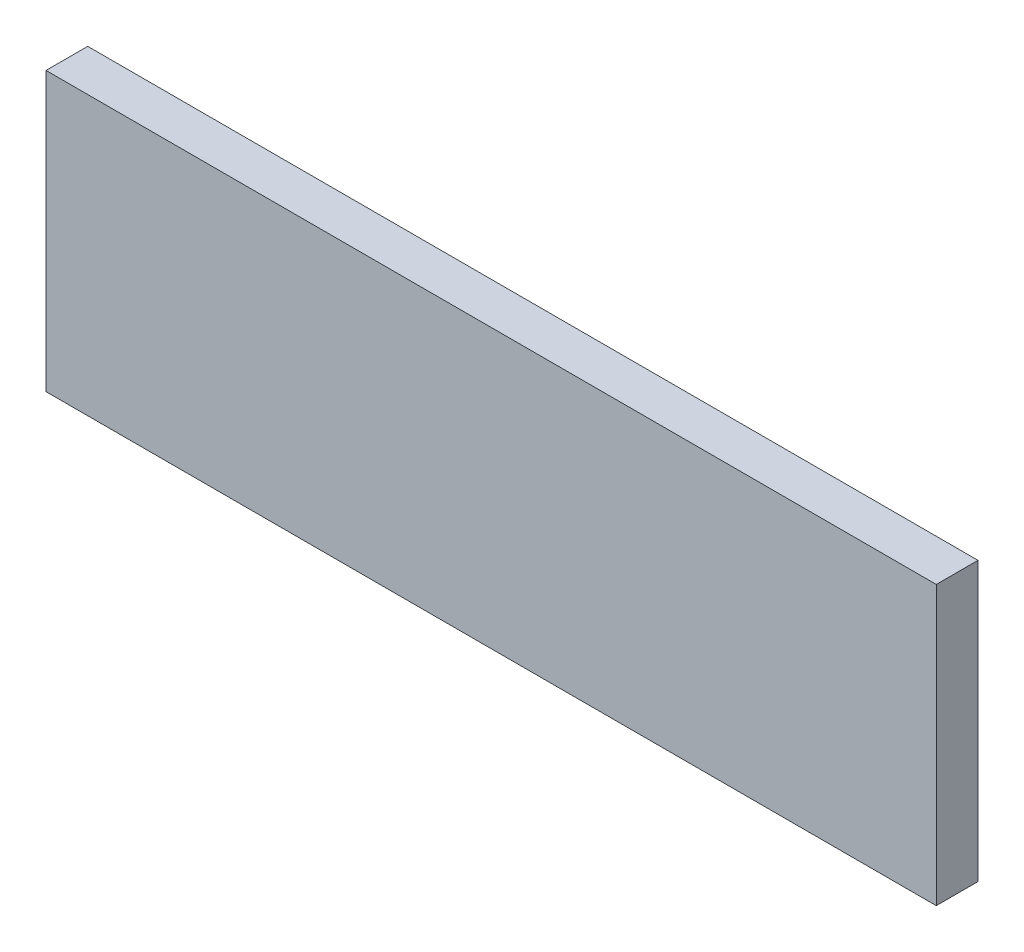
ISO-10303-21;
HEADER;
FILE_DESCRIPTION(('STEP AP214'),'2;1');
FILE_NAME('part.step','',(''),(''),'','','');
FILE_SCHEMA(('AUTOMOTIVE_DESIGN { 1 0 10303 214 1 1 1 1 }'));
ENDSEC;
DATA;
#1=APPLICATION_CONTEXT('core data for automotive mechanical design processes');
#2=APPLICATION_PROTOCOL_DEFINITION('international standard','automotive_design',2000,#1);
#3=PRODUCT_CONTEXT('',#1,'mechanical');
#4=PRODUCT('Part','Part','',(#3));
#5=PRODUCT_RELATED_PRODUCT_CATEGORY('part','',(#4));
#6=PRODUCT_DEFINITION_FORMATION('','',#4);
#7=PRODUCT_DEFINITION_CONTEXT('part definition',#1,'design');
#8=PRODUCT_DEFINITION('design','',#6,#7);
#9=PRODUCT_DEFINITION_SHAPE('','',#8);
#10=(LENGTH_UNIT() NAMED_UNIT(*) SI_UNIT(.MILLI.,.METRE.));
#11=(NAMED_UNIT(*) PLANE_ANGLE_UNIT() SI_UNIT($,.RADIAN.));
#12=(NAMED_UNIT(*) SI_UNIT($,.STERADIAN.) SOLID_ANGLE_UNIT());
#13=UNCERTAINTY_MEASURE_WITH_UNIT(LENGTH_MEASURE(1.E-05),#10,'distance_accuracy_value','');
#14=(GEOMETRIC_REPRESENTATION_CONTEXT(3) GLOBAL_UNCERTAINTY_ASSIGNED_CONTEXT((#13)) GLOBAL_UNIT_ASSIGNED_CONTEXT((#10,
#11,#12)) REPRESENTATION_CONTEXT('',''));
#15=CARTESIAN_POINT('',(0.,0.,0.));
#16=DIRECTION('',(0.,0.,1.));
#17=DIRECTION('',(1.,0.,0.));
#18=AXIS2_PLACEMENT_3D('',#15,#16,#17);
#19=CARTESIAN_POINT('',(0.,100.,0.));
#20=DIRECTION('',(1.,0.,0.));
#21=DIRECTION('',(0.,0.,-1.));
#22=AXIS2_PLACEMENT_3D('',#19,#20,#21);
#23=PLANE('',#22);
#24=DIRECTION('',(0.,0.,1.));
#25=VECTOR('',#24,1.);
#26=CARTESIAN_POINT('',(0.,0.,0.));
#27=LINE('',#26,#25);
#28=CARTESIAN_POINT('',(0.,0.,-15.));
#29=VERTEX_POINT('',#28);
#30=CARTESIAN_POINT('',(0.,0.,0.));
#31=VERTEX_POINT('',#30);
#32=EDGE_CURVE('E98',#29,#31,#27,.T.);
#33=ORIENTED_EDGE('',*,*,#32,.T.);
#34=DIRECTION('',(0.,-1.,0.));
#35=VECTOR('',#34,1.);
#36=CARTESIAN_POINT('',(0.,100.,0.));
#37=LINE('',#36,#35);
#38=CARTESIAN_POINT('',(0.,100.,0.));
#39=VERTEX_POINT('',#38);
#40=EDGE_CURVE('E11',#39,#31,#37,.T.);
#41=ORIENTED_EDGE('',*,*,#40,.F.);
#42=DIRECTION('',(0.,0.,1.));
#43=VECTOR('',#42,1.);
#44=CARTESIAN_POINT('',(0.,100.,0.));
#45=LINE('',#44,#43);
#46=CARTESIAN_POINT('',(0.,100.,-15.));
#47=VERTEX_POINT('',#46);
#48=EDGE_CURVE('E86',#47,#39,#45,.T.);
#49=ORIENTED_EDGE('',*,*,#48,.F.);
#50=DIRECTION('',(0.,-1.,0.));
#51=VECTOR('',#50,1.);
#52=CARTESIAN_POINT('',(0.,100.,-15.));
#53=LINE('',#52,#51);
#54=EDGE_CURVE('E94',#47,#29,#53,.T.);
#55=ORIENTED_EDGE('',*,*,#54,.T.);
#56=EDGE_LOOP('',(#33,#41,#49,#55));
#57=FACE_BOUND('',#56,.T.);
#58=ADVANCED_FACE('F35',(#57),#23,.F.);
#59=CARTESIAN_POINT('',(0.,100.,0.));
#60=DIRECTION('',(0.,0.,-1.));
#61=DIRECTION('',(-1.,0.,0.));
#62=AXIS2_PLACEMENT_3D('',#59,#60,#61);
#63=PLANE('',#62);
#64=DIRECTION('',(1.,0.,0.));
#65=VECTOR('',#64,1.);
#66=CARTESIAN_POINT('',(0.,0.,0.));
#67=LINE('',#66,#65);
#68=CARTESIAN_POINT('',(320.,0.,0.));
#69=VERTEX_POINT('',#68);
#70=EDGE_CURVE('E90',#31,#69,#67,.T.);
#71=ORIENTED_EDGE('',*,*,#70,.T.);
#72=DIRECTION('',(0.,-1.,0.));
#73=VECTOR('',#72,1.);
#74=CARTESIAN_POINT('',(320.,100.,0.));
#75=LINE('',#74,#73);
#76=CARTESIAN_POINT('',(320.,100.,0.));
#77=VERTEX_POINT('',#76);
#78=EDGE_CURVE('E43',#77,#69,#75,.T.);
#79=ORIENTED_EDGE('',*,*,#78,.F.);
#80=DIRECTION('',(1.,0.,0.));
#81=VECTOR('',#80,1.);
#82=CARTESIAN_POINT('',(0.,100.,0.));
#83=LINE('',#82,#81);
#84=EDGE_CURVE('E81',#39,#77,#83,.T.);
#85=ORIENTED_EDGE('',*,*,#84,.F.);
#86=ORIENTED_EDGE('',*,*,#40,.T.);
#87=EDGE_LOOP('',(#71,#79,#85,#86));
#88=FACE_BOUND('',#87,.T.);
#89=ADVANCED_FACE('F89',(#88),#63,.F.);
#90=CARTESIAN_POINT('',(320.,100.,0.));
#91=DIRECTION('',(-1.,0.,0.));
#92=DIRECTION('',(0.,0.,1.));
#93=AXIS2_PLACEMENT_3D('',#90,#91,#92);
#94=PLANE('',#93);
#95=DIRECTION('',(0.,0.,-1.));
#96=VECTOR('',#95,1.);
#97=CARTESIAN_POINT('',(320.,0.,0.));
#98=LINE('',#97,#96);
#99=CARTESIAN_POINT('',(320.,0.,-15.));
#100=VERTEX_POINT('',#99);
#101=EDGE_CURVE('E68',#69,#100,#98,.T.);
#102=ORIENTED_EDGE('',*,*,#101,.T.);
#103=DIRECTION('',(0.,-1.,0.));
#104=VECTOR('',#103,1.);
#105=CARTESIAN_POINT('',(320.,100.,-15.));
#106=LINE('',#105,#104);
#107=CARTESIAN_POINT('',(320.,100.,-15.));
#108=VERTEX_POINT('',#107);
#109=EDGE_CURVE('E91',#108,#100,#106,.T.);
#110=ORIENTED_EDGE('',*,*,#109,.F.);
#111=DIRECTION('',(0.,0.,-1.));
#112=VECTOR('',#111,1.);
#113=CARTESIAN_POINT('',(320.,100.,0.));
#114=LINE('',#113,#112);
#115=EDGE_CURVE('E84',#77,#108,#114,.T.);
#116=ORIENTED_EDGE('',*,*,#115,.F.);
#117=ORIENTED_EDGE('',*,*,#78,.T.);
#118=EDGE_LOOP('',(#102,#110,#116,#117));
#119=FACE_BOUND('',#118,.T.);
#120=ADVANCED_FACE('F92',(#119),#94,.F.);
#121=CARTESIAN_POINT('',(0.,100.,-15.));
#122=DIRECTION('',(0.,0.,1.));
#123=DIRECTION('',(1.,0.,0.));
#124=AXIS2_PLACEMENT_3D('',#121,#122,#123);
#125=PLANE('',#124);
#126=DIRECTION('',(-1.,0.,0.));
#127=VECTOR('',#126,1.);
#128=CARTESIAN_POINT('',(0.,0.,-15.));
#129=LINE('',#128,#127);
#130=EDGE_CURVE('E74',#100,#29,#129,.T.);
#131=ORIENTED_EDGE('',*,*,#130,.T.);
#132=ORIENTED_EDGE('',*,*,#54,.F.);
#133=DIRECTION('',(-1.,0.,0.));
#134=VECTOR('',#133,1.);
#135=CARTESIAN_POINT('',(0.,100.,-15.));
#136=LINE('',#135,#134);
#137=EDGE_CURVE('E51',#108,#47,#136,.T.);
#138=ORIENTED_EDGE('',*,*,#137,.F.);
#139=ORIENTED_EDGE('',*,*,#109,.T.);
#140=EDGE_LOOP('',(#131,#132,#138,#139));
#141=FACE_BOUND('',#140,.T.);
#142=ADVANCED_FACE('F105',(#141),#125,.F.);
#143=CARTESIAN_POINT('',(0.,100.,0.));
#144=DIRECTION('',(0.,-1.,0.));
#145=DIRECTION('',(0.,0.,-1.));
#146=AXIS2_PLACEMENT_3D('',#143,#144,#145);
#147=PLANE('',#146);
#148=ORIENTED_EDGE('',*,*,#48,.T.);
#149=ORIENTED_EDGE('',*,*,#84,.T.);
#150=ORIENTED_EDGE('',*,*,#115,.T.);
#151=ORIENTED_EDGE('',*,*,#137,.T.);
#152=EDGE_LOOP('',(#148,#149,#150,#151));
#153=FACE_BOUND('',#152,.T.);
#154=ADVANCED_FACE('F82',(#153),#147,.F.);
#155=CARTESIAN_POINT('',(0.,0.,0.));
#156=DIRECTION('',(0.,-1.,0.));
#157=DIRECTION('',(0.,0.,-1.));
#158=AXIS2_PLACEMENT_3D('',#155,#156,#157);
#159=PLANE('',#158);
#160=ORIENTED_EDGE('',*,*,#32,.F.);
#161=ORIENTED_EDGE('',*,*,#130,.F.);
#162=ORIENTED_EDGE('',*,*,#101,.F.);
#163=ORIENTED_EDGE('',*,*,#70,.F.);
#164=EDGE_LOOP('',(#160,#161,#162,#163));
#165=FACE_BOUND('',#164,.T.);
#166=ADVANCED_FACE('F108',(#165),#159,.T.);
#167=CLOSED_SHELL('',(#58,#89,#120,#142,#154,#166));
#168=MANIFOLD_SOLID_BREP('B2',#167);
#169=ADVANCED_BREP_SHAPE_REPRESENTATION('',(#18,#168),#14);
#170=SHAPE_DEFINITION_REPRESENTATION(#9,#169);
ENDSEC;
END-ISO-10303-21;
